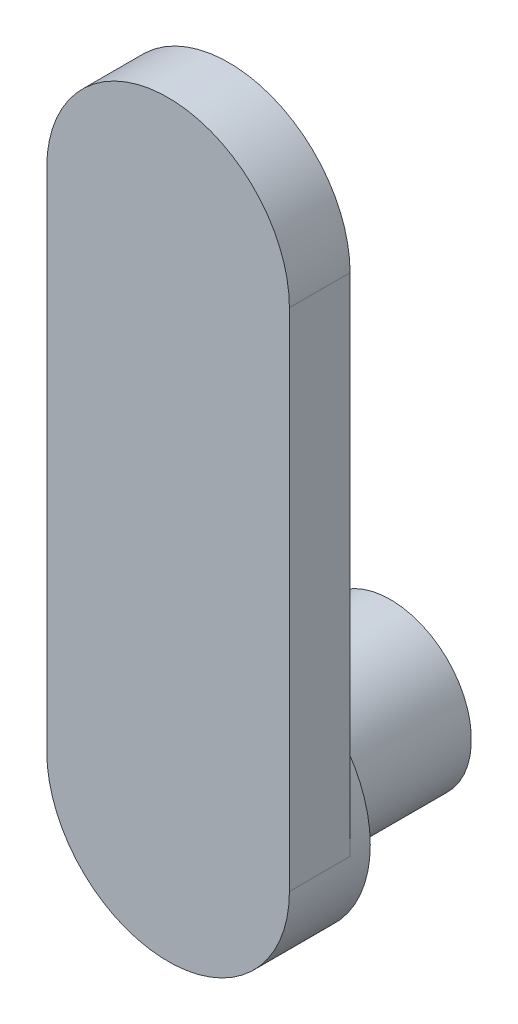
ISO-10303-21;
HEADER;
FILE_DESCRIPTION(('STEP AP214'),'2;1');
FILE_NAME('part.step','',(''),(''),'','','');
FILE_SCHEMA(('AUTOMOTIVE_DESIGN { 1 0 10303 214 1 1 1 1 }'));
ENDSEC;
DATA;
#1=APPLICATION_CONTEXT('core data for automotive mechanical design processes');
#2=APPLICATION_PROTOCOL_DEFINITION('international standard','automotive_design',2000,#1);
#3=PRODUCT_CONTEXT('',#1,'mechanical');
#4=PRODUCT('Part','Part','',(#3));
#5=PRODUCT_RELATED_PRODUCT_CATEGORY('part','',(#4));
#6=PRODUCT_DEFINITION_FORMATION('','',#4);
#7=PRODUCT_DEFINITION_CONTEXT('part definition',#1,'design');
#8=PRODUCT_DEFINITION('design','',#6,#7);
#9=PRODUCT_DEFINITION_SHAPE('','',#8);
#10=(LENGTH_UNIT() NAMED_UNIT(*) SI_UNIT(.MILLI.,.METRE.));
#11=(NAMED_UNIT(*) PLANE_ANGLE_UNIT() SI_UNIT($,.RADIAN.));
#12=(NAMED_UNIT(*) SI_UNIT($,.STERADIAN.) SOLID_ANGLE_UNIT());
#13=UNCERTAINTY_MEASURE_WITH_UNIT(LENGTH_MEASURE(1.E-05),#10,'distance_accuracy_value','');
#14=(GEOMETRIC_REPRESENTATION_CONTEXT(3) GLOBAL_UNCERTAINTY_ASSIGNED_CONTEXT((#13)) GLOBAL_UNIT_ASSIGNED_CONTEXT((#10,
#11,#12)) REPRESENTATION_CONTEXT('',''));
#15=CARTESIAN_POINT('',(0.,0.,0.));
#16=DIRECTION('',(0.,0.,1.));
#17=DIRECTION('',(1.,0.,0.));
#18=AXIS2_PLACEMENT_3D('',#15,#16,#17);
#19=CARTESIAN_POINT('',(0.,0.,-1.));
#20=DIRECTION('',(0.,0.,1.));
#21=DIRECTION('',(1.,0.,0.));
#22=AXIS2_PLACEMENT_3D('',#19,#20,#21);
#23=CYLINDRICAL_SURFACE('',#22,6.);
#24=CARTESIAN_POINT('',(0.,0.,-1.));
#25=DIRECTION('',(0.,0.,1.));
#26=DIRECTION('',(1.,0.,0.));
#27=AXIS2_PLACEMENT_3D('',#24,#25,#26);
#28=CIRCLE('',#27,6.);
#29=CARTESIAN_POINT('',(6.,0.,-1.));
#30=VERTEX_POINT('',#29);
#31=EDGE_CURVE('E41',#30,#30,#28,.T.);
#32=ORIENTED_EDGE('',*,*,#31,.T.);
#33=EDGE_LOOP('',(#32));
#34=FACE_BOUND('',#33,.T.);
#35=CARTESIAN_POINT('',(0.,0.,0.));
#36=DIRECTION('',(0.,0.,1.));
#37=DIRECTION('',(1.,0.,0.));
#38=AXIS2_PLACEMENT_3D('',#35,#36,#37);
#39=CIRCLE('',#38,6.);
#40=CARTESIAN_POINT('',(6.,0.,0.));
#41=VERTEX_POINT('',#40);
#42=CARTESIAN_POINT('',(-6.,0.,0.));
#43=VERTEX_POINT('',#42);
#44=EDGE_CURVE('E36',#41,#43,#39,.T.);
#45=ORIENTED_EDGE('',*,*,#44,.F.);
#46=DIRECTION('',(0.,0.,-1.));
#47=VECTOR('',#46,1.);
#48=CARTESIAN_POINT('',(6.,0.,3.));
#49=LINE('',#48,#47);
#50=CARTESIAN_POINT('',(6.,0.,3.));
#51=VERTEX_POINT('',#50);
#52=EDGE_CURVE('E93',#51,#41,#49,.T.);
#53=ORIENTED_EDGE('',*,*,#52,.F.);
#54=CARTESIAN_POINT('',(0.,0.,3.));
#55=DIRECTION('',(0.,0.,1.));
#56=DIRECTION('',(1.,0.,0.));
#57=AXIS2_PLACEMENT_3D('',#54,#55,#56);
#58=CIRCLE('',#57,6.);
#59=CARTESIAN_POINT('',(-6.,0.,3.));
#60=VERTEX_POINT('',#59);
#61=EDGE_CURVE('E87',#60,#51,#58,.T.);
#62=ORIENTED_EDGE('',*,*,#61,.F.);
#63=DIRECTION('',(0.,0.,-1.));
#64=VECTOR('',#63,1.);
#65=CARTESIAN_POINT('',(-6.,0.,3.));
#66=LINE('',#65,#64);
#67=EDGE_CURVE('E98',#60,#43,#66,.T.);
#68=ORIENTED_EDGE('',*,*,#67,.T.);
#69=EDGE_LOOP('',(#45,#53,#62,#68));
#70=FACE_BOUND('',#69,.T.);
#71=ADVANCED_FACE('F33',(#34,#70),#23,.T.);
#72=CARTESIAN_POINT('',(0.,0.,-1.));
#73=DIRECTION('',(0.,0.,1.));
#74=DIRECTION('',(1.,0.,0.));
#75=AXIS2_PLACEMENT_3D('',#72,#73,#74);
#76=PLANE('',#75);
#77=CARTESIAN_POINT('',(0.,0.,-1.));
#78=DIRECTION('',(0.,0.,-1.));
#79=DIRECTION('',(-1.,0.,0.));
#80=AXIS2_PLACEMENT_3D('',#77,#78,#79);
#81=CIRCLE('',#80,4.);
#82=CARTESIAN_POINT('',(-4.,0.,-1.));
#83=VERTEX_POINT('',#82);
#84=EDGE_CURVE('E11',#83,#83,#81,.T.);
#85=ORIENTED_EDGE('',*,*,#84,.F.);
#86=EDGE_LOOP('',(#85));
#87=FACE_BOUND('',#86,.T.);
#88=ORIENTED_EDGE('',*,*,#31,.F.);
#89=EDGE_LOOP('',(#88));
#90=FACE_BOUND('',#89,.T.);
#91=ADVANCED_FACE('F115',(#87,#90),#76,.F.);
#92=CARTESIAN_POINT('',(0.,0.,0.));
#93=DIRECTION('',(0.,0.,1.));
#94=DIRECTION('',(1.,0.,0.));
#95=AXIS2_PLACEMENT_3D('',#92,#93,#94);
#96=PLANE('',#95);
#97=DIRECTION('',(0.,1.,0.));
#98=VECTOR('',#97,1.);
#99=CARTESIAN_POINT('',(6.,0.,0.));
#100=LINE('',#99,#98);
#101=CARTESIAN_POINT('',(6.,25.,0.));
#102=VERTEX_POINT('',#101);
#103=EDGE_CURVE('E92',#41,#102,#100,.T.);
#104=ORIENTED_EDGE('',*,*,#103,.F.);
#105=ORIENTED_EDGE('',*,*,#44,.T.);
#106=DIRECTION('',(0.,-1.,0.));
#107=VECTOR('',#106,1.);
#108=CARTESIAN_POINT('',(-6.,0.,0.));
#109=LINE('',#108,#107);
#110=CARTESIAN_POINT('',(-6.,25.,0.));
#111=VERTEX_POINT('',#110);
#112=EDGE_CURVE('E105',#111,#43,#109,.T.);
#113=ORIENTED_EDGE('',*,*,#112,.F.);
#114=CARTESIAN_POINT('',(0.,25.,0.));
#115=DIRECTION('',(0.,0.,1.));
#116=DIRECTION('',(1.,0.,0.));
#117=AXIS2_PLACEMENT_3D('',#114,#115,#116);
#118=CIRCLE('',#117,6.);
#119=EDGE_CURVE('E74',#102,#111,#118,.T.);
#120=ORIENTED_EDGE('',*,*,#119,.F.);
#121=EDGE_LOOP('',(#104,#105,#113,#120));
#122=FACE_BOUND('',#121,.T.);
#123=ADVANCED_FACE('F117',(#122),#96,.F.);
#124=CARTESIAN_POINT('',(6.,0.,3.));
#125=DIRECTION('',(-1.,0.,0.));
#126=DIRECTION('',(0.,0.,1.));
#127=AXIS2_PLACEMENT_3D('',#124,#125,#126);
#128=PLANE('',#127);
#129=ORIENTED_EDGE('',*,*,#103,.T.);
#130=DIRECTION('',(0.,0.,-1.));
#131=VECTOR('',#130,1.);
#132=CARTESIAN_POINT('',(6.,25.,3.));
#133=LINE('',#132,#131);
#134=CARTESIAN_POINT('',(6.,25.,3.));
#135=VERTEX_POINT('',#134);
#136=EDGE_CURVE('E90',#135,#102,#133,.T.);
#137=ORIENTED_EDGE('',*,*,#136,.F.);
#138=DIRECTION('',(0.,1.,0.));
#139=VECTOR('',#138,1.);
#140=CARTESIAN_POINT('',(6.,0.,3.));
#141=LINE('',#140,#139);
#142=EDGE_CURVE('E82',#51,#135,#141,.T.);
#143=ORIENTED_EDGE('',*,*,#142,.F.);
#144=ORIENTED_EDGE('',*,*,#52,.T.);
#145=EDGE_LOOP('',(#129,#137,#143,#144));
#146=FACE_BOUND('',#145,.T.);
#147=ADVANCED_FACE('F91',(#146),#128,.F.);
#148=CARTESIAN_POINT('',(0.,25.,3.));
#149=DIRECTION('',(0.,0.,-1.));
#150=DIRECTION('',(-1.,0.,0.));
#151=AXIS2_PLACEMENT_3D('',#148,#149,#150);
#152=CYLINDRICAL_SURFACE('',#151,6.);
#153=ORIENTED_EDGE('',*,*,#119,.T.);
#154=DIRECTION('',(0.,0.,-1.));
#155=VECTOR('',#154,1.);
#156=CARTESIAN_POINT('',(-6.,25.,3.));
#157=LINE('',#156,#155);
#158=CARTESIAN_POINT('',(-6.,25.,3.));
#159=VERTEX_POINT('',#158);
#160=EDGE_CURVE('E94',#159,#111,#157,.T.);
#161=ORIENTED_EDGE('',*,*,#160,.F.);
#162=CARTESIAN_POINT('',(0.,25.,3.));
#163=DIRECTION('',(0.,0.,1.));
#164=DIRECTION('',(1.,0.,0.));
#165=AXIS2_PLACEMENT_3D('',#162,#163,#164);
#166=CIRCLE('',#165,6.);
#167=EDGE_CURVE('E85',#135,#159,#166,.T.);
#168=ORIENTED_EDGE('',*,*,#167,.F.);
#169=ORIENTED_EDGE('',*,*,#136,.T.);
#170=EDGE_LOOP('',(#153,#161,#168,#169));
#171=FACE_BOUND('',#170,.T.);
#172=ADVANCED_FACE('F96',(#171),#152,.T.);
#173=CARTESIAN_POINT('',(-6.,0.,3.));
#174=DIRECTION('',(1.,0.,0.));
#175=DIRECTION('',(0.,0.,-1.));
#176=AXIS2_PLACEMENT_3D('',#173,#174,#175);
#177=PLANE('',#176);
#178=ORIENTED_EDGE('',*,*,#112,.T.);
#179=ORIENTED_EDGE('',*,*,#67,.F.);
#180=DIRECTION('',(0.,-1.,0.));
#181=VECTOR('',#180,1.);
#182=CARTESIAN_POINT('',(-6.,0.,3.));
#183=LINE('',#182,#181);
#184=EDGE_CURVE('E57',#159,#60,#183,.T.);
#185=ORIENTED_EDGE('',*,*,#184,.F.);
#186=ORIENTED_EDGE('',*,*,#160,.T.);
#187=EDGE_LOOP('',(#178,#179,#185,#186));
#188=FACE_BOUND('',#187,.T.);
#189=ADVANCED_FACE('F130',(#188),#177,.F.);
#190=CARTESIAN_POINT('',(0.,0.,3.));
#191=DIRECTION('',(0.,0.,1.));
#192=DIRECTION('',(1.,0.,0.));
#193=AXIS2_PLACEMENT_3D('',#190,#191,#192);
#194=PLANE('',#193);
#195=ORIENTED_EDGE('',*,*,#61,.T.);
#196=ORIENTED_EDGE('',*,*,#142,.T.);
#197=ORIENTED_EDGE('',*,*,#167,.T.);
#198=ORIENTED_EDGE('',*,*,#184,.T.);
#199=EDGE_LOOP('',(#195,#196,#197,#198));
#200=FACE_BOUND('',#199,.T.);
#201=ADVANCED_FACE('F83',(#200),#194,.T.);
#202=CARTESIAN_POINT('',(0.,0.,-8.));
#203=DIRECTION('',(0.,0.,1.));
#204=DIRECTION('',(1.,0.,0.));
#205=AXIS2_PLACEMENT_3D('',#202,#203,#204);
#206=CYLINDRICAL_SURFACE('',#205,4.);
#207=CARTESIAN_POINT('',(0.,0.,-8.));
#208=DIRECTION('',(0.,0.,-1.));
#209=DIRECTION('',(-1.,0.,0.));
#210=AXIS2_PLACEMENT_3D('',#207,#208,#209);
#211=CIRCLE('',#210,4.);
#212=CARTESIAN_POINT('',(-4.,0.,-8.));
#213=VERTEX_POINT('',#212);
#214=EDGE_CURVE('E103',#213,#213,#211,.T.);
#215=ORIENTED_EDGE('',*,*,#214,.F.);
#216=EDGE_LOOP('',(#215));
#217=FACE_BOUND('',#216,.T.);
#218=ORIENTED_EDGE('',*,*,#84,.T.);
#219=EDGE_LOOP('',(#218));
#220=FACE_BOUND('',#219,.T.);
#221=ADVANCED_FACE('F136',(#217,#220),#206,.T.);
#222=CARTESIAN_POINT('',(0.,0.,-8.));
#223=DIRECTION('',(0.,0.,-1.));
#224=DIRECTION('',(-1.,0.,0.));
#225=AXIS2_PLACEMENT_3D('',#222,#223,#224);
#226=PLANE('',#225);
#227=ORIENTED_EDGE('',*,*,#214,.T.);
#228=EDGE_LOOP('',(#227));
#229=FACE_BOUND('',#228,.T.);
#230=ADVANCED_FACE('F139',(#229),#226,.T.);
#231=CLOSED_SHELL('',(#71,#91,#123,#147,#172,#189,#201,#221,#230));
#232=MANIFOLD_SOLID_BREP('B2',#231);
#233=ADVANCED_BREP_SHAPE_REPRESENTATION('',(#18,#232),#14);
#234=SHAPE_DEFINITION_REPRESENTATION(#9,#233);
ENDSEC;
END-ISO-10303-21;
